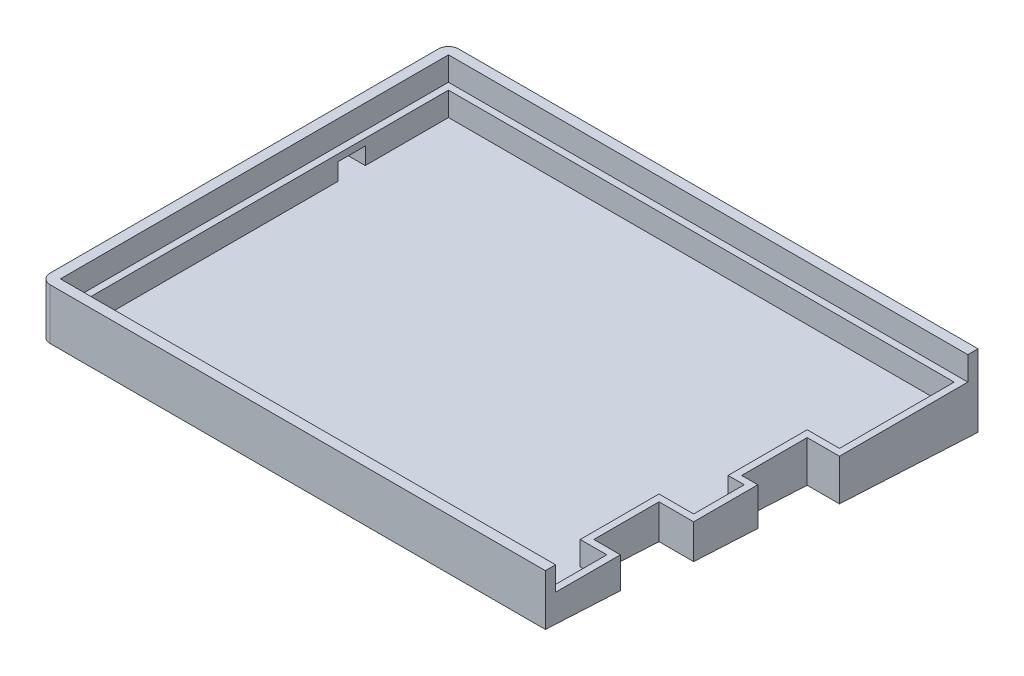
ISO-10303-21;
HEADER;
FILE_DESCRIPTION(('STEP AP214'),'2;1');
FILE_NAME('part.step','',(''),(''),'','','');
FILE_SCHEMA(('AUTOMOTIVE_DESIGN { 1 0 10303 214 1 1 1 1 }'));
ENDSEC;
DATA;
#1=APPLICATION_CONTEXT('core data for automotive mechanical design processes');
#2=APPLICATION_PROTOCOL_DEFINITION('international standard','automotive_design',2000,#1);
#3=PRODUCT_CONTEXT('',#1,'mechanical');
#4=PRODUCT('Part','Part','',(#3));
#5=PRODUCT_RELATED_PRODUCT_CATEGORY('part','',(#4));
#6=PRODUCT_DEFINITION_FORMATION('','',#4);
#7=PRODUCT_DEFINITION_CONTEXT('part definition',#1,'design');
#8=PRODUCT_DEFINITION('design','',#6,#7);
#9=PRODUCT_DEFINITION_SHAPE('','',#8);
#10=(LENGTH_UNIT() NAMED_UNIT(*) SI_UNIT(.MILLI.,.METRE.));
#11=(NAMED_UNIT(*) PLANE_ANGLE_UNIT() SI_UNIT($,.RADIAN.));
#12=(NAMED_UNIT(*) SI_UNIT($,.STERADIAN.) SOLID_ANGLE_UNIT());
#13=UNCERTAINTY_MEASURE_WITH_UNIT(LENGTH_MEASURE(1.E-05),#10,'distance_accuracy_value','');
#14=(GEOMETRIC_REPRESENTATION_CONTEXT(3) GLOBAL_UNCERTAINTY_ASSIGNED_CONTEXT((#13)) GLOBAL_UNIT_ASSIGNED_CONTEXT((#10,
#11,#12)) REPRESENTATION_CONTEXT('',''));
#15=CARTESIAN_POINT('',(0.,0.,0.));
#16=DIRECTION('',(0.,0.,1.));
#17=DIRECTION('',(1.,0.,0.));
#18=AXIS2_PLACEMENT_3D('',#15,#16,#17);
#19=CARTESIAN_POINT('',(0.,14.,3.));
#20=DIRECTION('',(0.,0.,-1.));
#21=DIRECTION('',(-1.,0.,0.));
#22=AXIS2_PLACEMENT_3D('',#19,#20,#21);
#23=PLANE('',#22);
#24=DIRECTION('',(1.,0.,0.));
#25=VECTOR('',#24,1.);
#26=CARTESIAN_POINT('',(0.,14.,3.));
#27=LINE('',#26,#25);
#28=CARTESIAN_POINT('',(0.,14.,3.));
#29=VERTEX_POINT('',#28);
#30=CARTESIAN_POINT('',(145.83,14.,3.));
#31=VERTEX_POINT('',#30);
#32=EDGE_CURVE('E465',#29,#31,#27,.T.);
#33=ORIENTED_EDGE('',*,*,#32,.F.);
#34=DIRECTION('',(0.,-1.,0.));
#35=VECTOR('',#34,1.);
#36=CARTESIAN_POINT('',(0.,-0.999999999999999,3.));
#37=LINE('',#36,#35);
#38=CARTESIAN_POINT('',(0.,-1.,3.));
#39=VERTEX_POINT('',#38);
#40=EDGE_CURVE('E500',#29,#39,#37,.T.);
#41=ORIENTED_EDGE('',*,*,#40,.T.);
#42=DIRECTION('',(1.,0.,0.));
#43=VECTOR('',#42,1.);
#44=CARTESIAN_POINT('',(0.,-1.,3.));
#45=LINE('',#44,#43);
#46=CARTESIAN_POINT('',(145.83,-1.,3.00000000000002));
#47=VERTEX_POINT('',#46);
#48=EDGE_CURVE('E455',#39,#47,#45,.T.);
#49=ORIENTED_EDGE('',*,*,#48,.T.);
#50=DIRECTION('',(0.,-1.,0.));
#51=VECTOR('',#50,1.);
#52=CARTESIAN_POINT('',(145.83,0.,3.));
#53=LINE('',#52,#51);
#54=EDGE_CURVE('E426',#31,#47,#53,.T.);
#55=ORIENTED_EDGE('',*,*,#54,.F.);
#56=EDGE_LOOP('',(#33,#41,#49,#55));
#57=FACE_BOUND('',#56,.T.);
#58=ADVANCED_FACE('F47',(#57),#23,.F.);
#59=CARTESIAN_POINT('',(-123.511553142895,-7.30413176995704,-117.29));
#60=DIRECTION('',(0.,-0.998629534754574,0.0523359562429439));
#61=DIRECTION('',(0.,-0.0523359562429439,-0.998629534754574));
#62=AXIS2_PLACEMENT_3D('',#59,#60,#61);
#63=PLANE('',#62);
#64=ORIENTED_EDGE('',*,*,#48,.F.);
#65=CARTESIAN_POINT('',(0.,-1.15722333784912,0.));
#66=DIRECTION('',(0.,-0.998629534754574,0.0523359562429439));
#67=DIRECTION('',(0.,0.052335956242944,0.998629534754574));
#68=AXIS2_PLACEMENT_3D('',#65,#66,#67);
#69=ELLIPSE('',#68,3.00411703799376,3.);
#70=CARTESIAN_POINT('',(-3.,-1.15722333784912,0.));
#71=VERTEX_POINT('',#70);
#72=EDGE_CURVE('E505',#39,#71,#69,.T.);
#73=ORIENTED_EDGE('',*,*,#72,.T.);
#74=DIRECTION('',(0.,-0.0523359562429439,-0.998629534754574));
#75=VECTOR('',#74,1.);
#76=CARTESIAN_POINT('',(-3.,-7.30413176995704,-117.29));
#77=LINE('',#76,#75);
#78=CARTESIAN_POINT('',(-3.,-7.14690843210792,-114.29));
#79=VERTEX_POINT('',#78);
#80=EDGE_CURVE('E450',#71,#79,#77,.T.);
#81=ORIENTED_EDGE('',*,*,#80,.T.);
#82=CARTESIAN_POINT('',(0.,-7.14690843210791,-114.29));
#83=DIRECTION('',(0.,-0.998629534754574,0.0523359562429439));
#84=DIRECTION('',(0.,-0.052335956242944,-0.998629534754574));
#85=AXIS2_PLACEMENT_3D('',#82,#83,#84);
#86=ELLIPSE('',#85,3.00411703799376,3.);
#87=CARTESIAN_POINT('',(0.,-7.30413176995704,-117.29));
#88=VERTEX_POINT('',#87);
#89=EDGE_CURVE('E503',#79,#88,#86,.T.);
#90=ORIENTED_EDGE('',*,*,#89,.T.);
#91=DIRECTION('',(1.,0.,0.));
#92=VECTOR('',#91,1.);
#93=CARTESIAN_POINT('',(-123.511553142895,-7.30413176995704,-117.29));
#94=LINE('',#93,#92);
#95=CARTESIAN_POINT('',(152.94,-7.30413176995704,-117.29));
#96=VERTEX_POINT('',#95);
#97=EDGE_CURVE('E453',#88,#96,#94,.T.);
#98=ORIENTED_EDGE('',*,*,#97,.T.);
#99=DIRECTION('',(0.,-0.0523359562429439,-0.998629534754574));
#100=VECTOR('',#99,1.);
#101=CARTESIAN_POINT('',(152.94,-7.30413176995704,-117.29));
#102=LINE('',#101,#100);
#103=CARTESIAN_POINT('',(152.94,-5.16589437520895,-76.49));
#104=VERTEX_POINT('',#103);
#105=EDGE_CURVE('E438',#104,#96,#102,.T.);
#106=ORIENTED_EDGE('',*,*,#105,.F.);
#107=DIRECTION('',(1.,0.,0.));
#108=VECTOR('',#107,1.);
#109=CARTESIAN_POINT('',(-123.511553142895,-5.16589437520896,-76.49));
#110=LINE('',#109,#108);
#111=CARTESIAN_POINT('',(143.44,-5.16589437520896,-76.49));
#112=VERTEX_POINT('',#111);
#113=EDGE_CURVE('E486',#112,#104,#110,.T.);
#114=ORIENTED_EDGE('',*,*,#113,.F.);
#115=DIRECTION('',(0.,-0.0523359562429439,-0.998629534754574));
#116=VECTOR('',#115,1.);
#117=CARTESIAN_POINT('',(143.44,-7.30413176995704,-117.29));
#118=LINE('',#117,#116);
#119=CARTESIAN_POINT('',(143.44,-4.15442423504626,-57.19));
#120=VERTEX_POINT('',#119);
#121=EDGE_CURVE('E488',#120,#112,#118,.T.);
#122=ORIENTED_EDGE('',*,*,#121,.F.);
#123=DIRECTION('',(-1.,0.,0.));
#124=VECTOR('',#123,1.);
#125=CARTESIAN_POINT('',(-123.511553142895,-4.15442423504626,-57.19));
#126=LINE('',#125,#124);
#127=CARTESIAN_POINT('',(148.2,-4.15442423504626,-57.19));
#128=VERTEX_POINT('',#127);
#129=EDGE_CURVE('E491',#128,#120,#126,.T.);
#130=ORIENTED_EDGE('',*,*,#129,.F.);
#131=DIRECTION('',(0.,-0.0523359562429439,-0.998629534754574));
#132=VECTOR('',#131,1.);
#133=CARTESIAN_POINT('',(148.2,-7.30413176995704,-117.29));
#134=LINE('',#133,#132);
#135=CARTESIAN_POINT('',(148.2,-3.16391720659678,-38.29));
#136=VERTEX_POINT('',#135);
#137=EDGE_CURVE('E493',#136,#128,#134,.T.);
#138=ORIENTED_EDGE('',*,*,#137,.F.);
#139=DIRECTION('',(1.,0.,0.));
#140=VECTOR('',#139,1.);
#141=CARTESIAN_POINT('',(-123.511553142895,-3.16391720659678,-38.29));
#142=LINE('',#141,#140);
#143=CARTESIAN_POINT('',(138.,-3.16391720659678,-38.29));
#144=VERTEX_POINT('',#143);
#145=EDGE_CURVE('E495',#144,#136,#142,.T.);
#146=ORIENTED_EDGE('',*,*,#145,.F.);
#147=DIRECTION('',(0.,0.0523359562429439,0.998629534754574));
#148=VECTOR('',#147,1.);
#149=CARTESIAN_POINT('',(138.,-7.30413176995704,-117.29));
#150=LINE('',#149,#148);
#151=CARTESIAN_POINT('',(138.,-2.15768784436238,-19.09));
#152=VERTEX_POINT('',#151);
#153=EDGE_CURVE('E497',#144,#152,#150,.T.);
#154=ORIENTED_EDGE('',*,*,#153,.T.);
#155=DIRECTION('',(-1.,0.,0.));
#156=VECTOR('',#155,1.);
#157=CARTESIAN_POINT('',(145.83,-2.15768784436238,-19.09));
#158=LINE('',#157,#156);
#159=CARTESIAN_POINT('',(145.83,-2.15768784436238,-19.09));
#160=VERTEX_POINT('',#159);
#161=EDGE_CURVE('E431',#160,#152,#158,.T.);
#162=ORIENTED_EDGE('',*,*,#161,.F.);
#163=DIRECTION('',(0.,-0.0523359562429439,-0.998629534754574));
#164=VECTOR('',#163,1.);
#165=CARTESIAN_POINT('',(145.83,-1.15405364258562,0.0604813885814169));
#166=LINE('',#165,#164);
#167=EDGE_CURVE('E429',#47,#160,#166,.T.);
#168=ORIENTED_EDGE('',*,*,#167,.F.);
#169=EDGE_LOOP('',(#64,#73,#81,#90,#98,#106,#114,#122,#130,#138,#146,#154,#162,#168));
#170=FACE_BOUND('',#169,.T.);
#171=ADVANCED_FACE('F528',(#170),#63,.T.);
#172=CARTESIAN_POINT('',(152.94,14.,0.));
#173=DIRECTION('',(1.,0.,0.));
#174=DIRECTION('',(0.,0.,-1.));
#175=AXIS2_PLACEMENT_3D('',#172,#173,#174);
#176=PLANE('',#175);
#177=DIRECTION('',(0.,0.,-1.));
#178=VECTOR('',#177,1.);
#179=CARTESIAN_POINT('',(152.94,7.,-76.49));
#180=LINE('',#179,#178);
#181=CARTESIAN_POINT('',(152.94,7.,-76.49));
#182=VERTEX_POINT('',#181);
#183=CARTESIAN_POINT('',(152.94,7.,-114.29));
#184=VERTEX_POINT('',#183);
#185=EDGE_CURVE('E413',#182,#184,#180,.T.);
#186=ORIENTED_EDGE('',*,*,#185,.F.);
#187=DIRECTION('',(0.,1.,0.));
#188=VECTOR('',#187,1.);
#189=CARTESIAN_POINT('',(152.94,-10.,-76.49));
#190=LINE('',#189,#188);
#191=EDGE_CURVE('E435',#104,#182,#190,.T.);
#192=ORIENTED_EDGE('',*,*,#191,.F.);
#193=ORIENTED_EDGE('',*,*,#105,.T.);
#194=DIRECTION('',(0.,-1.,0.));
#195=VECTOR('',#194,1.);
#196=CARTESIAN_POINT('',(152.94,14.,-117.29));
#197=LINE('',#196,#195);
#198=CARTESIAN_POINT('',(152.94,14.,-117.29));
#199=VERTEX_POINT('',#198);
#200=EDGE_CURVE('E483',#199,#96,#197,.T.);
#201=ORIENTED_EDGE('',*,*,#200,.F.);
#202=DIRECTION('',(0.,0.,1.));
#203=VECTOR('',#202,1.);
#204=CARTESIAN_POINT('',(152.94,14.,0.));
#205=LINE('',#204,#203);
#206=CARTESIAN_POINT('',(152.94,14.,-114.29));
#207=VERTEX_POINT('',#206);
#208=EDGE_CURVE('E457',#199,#207,#205,.T.);
#209=ORIENTED_EDGE('',*,*,#208,.T.);
#210=DIRECTION('',(0.,-1.,0.));
#211=VECTOR('',#210,1.);
#212=CARTESIAN_POINT('',(152.94,14.,-114.29));
#213=LINE('',#212,#211);
#214=EDGE_CURVE('E474',#207,#184,#213,.T.);
#215=ORIENTED_EDGE('',*,*,#214,.T.);
#216=EDGE_LOOP('',(#186,#192,#193,#201,#209,#215));
#217=FACE_BOUND('',#216,.T.);
#218=ADVANCED_FACE('F543',(#217),#176,.T.);
#219=CARTESIAN_POINT('',(0.,14.,-117.29));
#220=DIRECTION('',(0.,0.,-1.));
#221=DIRECTION('',(-1.,0.,0.));
#222=AXIS2_PLACEMENT_3D('',#219,#220,#221);
#223=PLANE('',#222);
#224=ORIENTED_EDGE('',*,*,#97,.F.);
#225=DIRECTION('',(0.,-1.,0.));
#226=VECTOR('',#225,1.);
#227=CARTESIAN_POINT('',(0.,14.,-117.29));
#228=LINE('',#227,#226);
#229=CARTESIAN_POINT('',(0.,14.,-117.29));
#230=VERTEX_POINT('',#229);
#231=EDGE_CURVE('E11',#88,#230,#228,.F.);
#232=ORIENTED_EDGE('',*,*,#231,.T.);
#233=DIRECTION('',(1.,0.,0.));
#234=VECTOR('',#233,1.);
#235=CARTESIAN_POINT('',(0.,14.,-117.29));
#236=LINE('',#235,#234);
#237=EDGE_CURVE('E460',#230,#199,#236,.T.);
#238=ORIENTED_EDGE('',*,*,#237,.T.);
#239=ORIENTED_EDGE('',*,*,#200,.T.);
#240=EDGE_LOOP('',(#224,#232,#238,#239));
#241=FACE_BOUND('',#240,.T.);
#242=ADVANCED_FACE('F537',(#241),#223,.T.);
#243=CARTESIAN_POINT('',(-3.,14.,0.));
#244=DIRECTION('',(-1.,0.,0.));
#245=DIRECTION('',(0.,0.,1.));
#246=AXIS2_PLACEMENT_3D('',#243,#244,#245);
#247=PLANE('',#246);
#248=DIRECTION('',(0.,-1.,0.));
#249=VECTOR('',#248,1.);
#250=CARTESIAN_POINT('',(-3.,0.,-79.69));
#251=LINE('',#250,#249);
#252=CARTESIAN_POINT('',(-3.,5.,-79.69));
#253=VERTEX_POINT('',#252);
#254=CARTESIAN_POINT('',(-3.,0.,-79.69));
#255=VERTEX_POINT('',#254);
#256=EDGE_CURVE('E279',#253,#255,#251,.T.);
#257=ORIENTED_EDGE('',*,*,#256,.T.);
#258=DIRECTION('',(0.,0.,-1.));
#259=VECTOR('',#258,1.);
#260=CARTESIAN_POINT('',(-3.,0.,0.));
#261=LINE('',#260,#259);
#262=CARTESIAN_POINT('',(-3.,0.,-87.79));
#263=VERTEX_POINT('',#262);
#264=EDGE_CURVE('E268',#255,#263,#261,.T.);
#265=ORIENTED_EDGE('',*,*,#264,.T.);
#266=DIRECTION('',(0.,-1.,0.));
#267=VECTOR('',#266,1.);
#268=CARTESIAN_POINT('',(-3.,0.,-87.79));
#269=LINE('',#268,#267);
#270=CARTESIAN_POINT('',(-3.,5.,-87.79));
#271=VERTEX_POINT('',#270);
#272=EDGE_CURVE('E286',#271,#263,#269,.T.);
#273=ORIENTED_EDGE('',*,*,#272,.F.);
#274=DIRECTION('',(0.,0.,-1.));
#275=VECTOR('',#274,1.);
#276=CARTESIAN_POINT('',(-3.,5.,0.));
#277=LINE('',#276,#275);
#278=EDGE_CURVE('E284',#253,#271,#277,.T.);
#279=ORIENTED_EDGE('',*,*,#278,.F.);
#280=EDGE_LOOP('',(#257,#265,#273,#279));
#281=FACE_BOUND('',#280,.T.);
#282=ORIENTED_EDGE('',*,*,#80,.F.);
#283=DIRECTION('',(0.,-1.,0.));
#284=VECTOR('',#283,1.);
#285=CARTESIAN_POINT('',(-3.,14.,0.));
#286=LINE('',#285,#284);
#287=CARTESIAN_POINT('',(-3.,14.,0.));
#288=VERTEX_POINT('',#287);
#289=EDGE_CURVE('E510',#71,#288,#286,.F.);
#290=ORIENTED_EDGE('',*,*,#289,.T.);
#291=DIRECTION('',(0.,0.,-1.));
#292=VECTOR('',#291,1.);
#293=CARTESIAN_POINT('',(-3.,14.,0.));
#294=LINE('',#293,#292);
#295=CARTESIAN_POINT('',(-3.,14.,-114.29));
#296=VERTEX_POINT('',#295);
#297=EDGE_CURVE('E462',#288,#296,#294,.T.);
#298=ORIENTED_EDGE('',*,*,#297,.T.);
#299=DIRECTION('',(0.,-1.,0.));
#300=VECTOR('',#299,1.);
#301=CARTESIAN_POINT('',(-3.,14.,-114.29));
#302=LINE('',#301,#300);
#303=EDGE_CURVE('E507',#296,#79,#302,.T.);
#304=ORIENTED_EDGE('',*,*,#303,.T.);
#305=EDGE_LOOP('',(#282,#290,#298,#304));
#306=FACE_BOUND('',#305,.T.);
#307=ADVANCED_FACE('F282',(#281,#306),#247,.T.);
#308=CARTESIAN_POINT('',(138.,14.,0.));
#309=DIRECTION('',(-1.,0.,0.));
#310=DIRECTION('',(0.,0.,1.));
#311=AXIS2_PLACEMENT_3D('',#308,#309,#310);
#312=PLANE('',#311);
#313=DIRECTION('',(0.,1.,0.));
#314=VECTOR('',#313,1.);
#315=CARTESIAN_POINT('',(138.,-10.,-38.29));
#316=LINE('',#315,#314);
#317=CARTESIAN_POINT('',(138.,7.,-38.29));
#318=VERTEX_POINT('',#317);
#319=EDGE_CURVE('E436',#144,#318,#316,.T.);
#320=ORIENTED_EDGE('',*,*,#319,.T.);
#321=DIRECTION('',(0.,0.,-1.));
#322=VECTOR('',#321,1.);
#323=CARTESIAN_POINT('',(138.,7.,-19.09));
#324=LINE('',#323,#322);
#325=CARTESIAN_POINT('',(138.,7.,-19.09));
#326=VERTEX_POINT('',#325);
#327=EDGE_CURVE('E395',#326,#318,#324,.T.);
#328=ORIENTED_EDGE('',*,*,#327,.F.);
#329=DIRECTION('',(0.,-1.,0.));
#330=VECTOR('',#329,1.);
#331=CARTESIAN_POINT('',(138.,0.,-19.09));
#332=LINE('',#331,#330);
#333=EDGE_CURVE('E417',#326,#152,#332,.T.);
#334=ORIENTED_EDGE('',*,*,#333,.T.);
#335=ORIENTED_EDGE('',*,*,#153,.F.);
#336=EDGE_LOOP('',(#320,#328,#334,#335));
#337=FACE_BOUND('',#336,.T.);
#338=ADVANCED_FACE('F584',(#337),#312,.F.);
#339=CARTESIAN_POINT('',(0.,14.,0.));
#340=DIRECTION('',(0.,0.,-1.));
#341=DIRECTION('',(-1.,0.,0.));
#342=AXIS2_PLACEMENT_3D('',#339,#340,#341);
#343=PLANE('',#342);
#344=DIRECTION('',(1.,0.,0.));
#345=VECTOR('',#344,1.);
#346=CARTESIAN_POINT('',(0.,7.,0.));
#347=LINE('',#346,#345);
#348=CARTESIAN_POINT('',(0.,7.,0.));
#349=VERTEX_POINT('',#348);
#350=CARTESIAN_POINT('',(145.83,7.,0.));
#351=VERTEX_POINT('',#350);
#352=EDGE_CURVE('E386',#349,#351,#347,.T.);
#353=ORIENTED_EDGE('',*,*,#352,.F.);
#354=DIRECTION('',(0.,-1.,0.));
#355=VECTOR('',#354,1.);
#356=CARTESIAN_POINT('',(0.,14.,0.));
#357=LINE('',#356,#355);
#358=CARTESIAN_POINT('',(0.,14.,0.));
#359=VERTEX_POINT('',#358);
#360=EDGE_CURVE('E480',#359,#349,#357,.T.);
#361=ORIENTED_EDGE('',*,*,#360,.F.);
#362=DIRECTION('',(1.,0.,0.));
#363=VECTOR('',#362,1.);
#364=CARTESIAN_POINT('',(0.,14.,0.));
#365=LINE('',#364,#363);
#366=CARTESIAN_POINT('',(145.83,14.,0.));
#367=VERTEX_POINT('',#366);
#368=EDGE_CURVE('E467',#359,#367,#365,.T.);
#369=ORIENTED_EDGE('',*,*,#368,.T.);
#370=DIRECTION('',(0.,1.,0.));
#371=VECTOR('',#370,1.);
#372=CARTESIAN_POINT('',(145.83,0.,0.));
#373=LINE('',#372,#371);
#374=EDGE_CURVE('E421',#351,#367,#373,.T.);
#375=ORIENTED_EDGE('',*,*,#374,.F.);
#376=EDGE_LOOP('',(#353,#361,#369,#375));
#377=FACE_BOUND('',#376,.T.);
#378=ADVANCED_FACE('F593',(#377),#343,.T.);
#379=CARTESIAN_POINT('',(0.,14.,0.));
#380=DIRECTION('',(-1.,0.,0.));
#381=DIRECTION('',(0.,0.,1.));
#382=AXIS2_PLACEMENT_3D('',#379,#380,#381);
#383=PLANE('',#382);
#384=ORIENTED_EDGE('',*,*,#360,.T.);
#385=DIRECTION('',(0.,0.,1.));
#386=VECTOR('',#385,1.);
#387=CARTESIAN_POINT('',(0.,7.,-114.29));
#388=LINE('',#387,#386);
#389=CARTESIAN_POINT('',(0.,7.,-114.29));
#390=VERTEX_POINT('',#389);
#391=EDGE_CURVE('E384',#390,#349,#388,.T.);
#392=ORIENTED_EDGE('',*,*,#391,.F.);
#393=DIRECTION('',(0.,-1.,0.));
#394=VECTOR('',#393,1.);
#395=CARTESIAN_POINT('',(0.,14.,-114.29));
#396=LINE('',#395,#394);
#397=CARTESIAN_POINT('',(0.,14.,-114.29));
#398=VERTEX_POINT('',#397);
#399=EDGE_CURVE('E477',#398,#390,#396,.T.);
#400=ORIENTED_EDGE('',*,*,#399,.F.);
#401=DIRECTION('',(0.,0.,-1.));
#402=VECTOR('',#401,1.);
#403=CARTESIAN_POINT('',(0.,14.,0.));
#404=LINE('',#403,#402);
#405=EDGE_CURVE('E470',#359,#398,#404,.T.);
#406=ORIENTED_EDGE('',*,*,#405,.F.);
#407=EDGE_LOOP('',(#384,#392,#400,#406));
#408=FACE_BOUND('',#407,.T.);
#409=ADVANCED_FACE('F595',(#408),#383,.F.);
#410=CARTESIAN_POINT('',(0.,14.,-114.29));
#411=DIRECTION('',(0.,0.,-1.));
#412=DIRECTION('',(-1.,0.,0.));
#413=AXIS2_PLACEMENT_3D('',#410,#411,#412);
#414=PLANE('',#413);
#415=ORIENTED_EDGE('',*,*,#399,.T.);
#416=DIRECTION('',(-1.,0.,0.));
#417=VECTOR('',#416,1.);
#418=CARTESIAN_POINT('',(152.94,7.,-114.29));
#419=LINE('',#418,#417);
#420=EDGE_CURVE('E415',#184,#390,#419,.T.);
#421=ORIENTED_EDGE('',*,*,#420,.F.);
#422=ORIENTED_EDGE('',*,*,#214,.F.);
#423=DIRECTION('',(1.,0.,0.));
#424=VECTOR('',#423,1.);
#425=CARTESIAN_POINT('',(0.,14.,-114.29));
#426=LINE('',#425,#424);
#427=EDGE_CURVE('E472',#398,#207,#426,.T.);
#428=ORIENTED_EDGE('',*,*,#427,.F.);
#429=EDGE_LOOP('',(#415,#421,#422,#428));
#430=FACE_BOUND('',#429,.T.);
#431=ADVANCED_FACE('F552',(#430),#414,.F.);
#432=CARTESIAN_POINT('',(0.,14.,0.));
#433=DIRECTION('',(0.,1.,0.));
#434=DIRECTION('',(0.,0.,1.));
#435=AXIS2_PLACEMENT_3D('',#432,#433,#434);
#436=PLANE('',#435);
#437=ORIENTED_EDGE('',*,*,#297,.F.);
#438=CARTESIAN_POINT('',(0.,14.,0.));
#439=DIRECTION('',(0.,1.,0.));
#440=DIRECTION('',(0.,0.,1.));
#441=AXIS2_PLACEMENT_3D('',#438,#439,#440);
#442=CIRCLE('',#441,3.);
#443=EDGE_CURVE('E55',#288,#29,#442,.T.);
#444=ORIENTED_EDGE('',*,*,#443,.T.);
#445=ORIENTED_EDGE('',*,*,#32,.T.);
#446=DIRECTION('',(0.,0.,1.));
#447=VECTOR('',#446,1.);
#448=CARTESIAN_POINT('',(145.83,14.,0.));
#449=LINE('',#448,#447);
#450=EDGE_CURVE('E423',#367,#31,#449,.T.);
#451=ORIENTED_EDGE('',*,*,#450,.F.);
#452=ORIENTED_EDGE('',*,*,#368,.F.);
#453=ORIENTED_EDGE('',*,*,#405,.T.);
#454=ORIENTED_EDGE('',*,*,#427,.T.);
#455=ORIENTED_EDGE('',*,*,#208,.F.);
#456=ORIENTED_EDGE('',*,*,#237,.F.);
#457=CARTESIAN_POINT('',(0.,14.,-114.29));
#458=DIRECTION('',(0.,1.,0.));
#459=DIRECTION('',(0.,0.,1.));
#460=AXIS2_PLACEMENT_3D('',#457,#458,#459);
#461=CIRCLE('',#460,3.);
#462=EDGE_CURVE('E512',#230,#296,#461,.T.);
#463=ORIENTED_EDGE('',*,*,#462,.T.);
#464=EDGE_LOOP('',(#437,#444,#445,#451,#452,#453,#454,#455,#456,#463));
#465=FACE_BOUND('',#464,.T.);
#466=ADVANCED_FACE('F517',(#465),#436,.T.);
#467=CARTESIAN_POINT('',(0.,-10.,-38.29));
#468=DIRECTION('',(0.,0.,-1.));
#469=DIRECTION('',(-1.,0.,0.));
#470=AXIS2_PLACEMENT_3D('',#467,#468,#469);
#471=PLANE('',#470);
#472=ORIENTED_EDGE('',*,*,#145,.T.);
#473=DIRECTION('',(0.,1.,0.));
#474=VECTOR('',#473,1.);
#475=CARTESIAN_POINT('',(148.2,-10.,-38.29));
#476=LINE('',#475,#474);
#477=CARTESIAN_POINT('',(148.2,7.,-38.29));
#478=VERTEX_POINT('',#477);
#479=EDGE_CURVE('E439',#136,#478,#476,.T.);
#480=ORIENTED_EDGE('',*,*,#479,.T.);
#481=DIRECTION('',(1.,0.,0.));
#482=VECTOR('',#481,1.);
#483=CARTESIAN_POINT('',(138.,7.,-38.29));
#484=LINE('',#483,#482);
#485=EDGE_CURVE('E398',#318,#478,#484,.T.);
#486=ORIENTED_EDGE('',*,*,#485,.F.);
#487=ORIENTED_EDGE('',*,*,#319,.F.);
#488=EDGE_LOOP('',(#472,#480,#486,#487));
#489=FACE_BOUND('',#488,.T.);
#490=ADVANCED_FACE('F581',(#489),#471,.F.);
#491=CARTESIAN_POINT('',(148.2,-10.,0.));
#492=DIRECTION('',(-1.,0.,0.));
#493=DIRECTION('',(0.,0.,1.));
#494=AXIS2_PLACEMENT_3D('',#491,#492,#493);
#495=PLANE('',#494);
#496=ORIENTED_EDGE('',*,*,#137,.T.);
#497=DIRECTION('',(0.,1.,0.));
#498=VECTOR('',#497,1.);
#499=CARTESIAN_POINT('',(148.2,-10.,-57.19));
#500=LINE('',#499,#498);
#501=CARTESIAN_POINT('',(148.2,7.,-57.19));
#502=VERTEX_POINT('',#501);
#503=EDGE_CURVE('E441',#128,#502,#500,.T.);
#504=ORIENTED_EDGE('',*,*,#503,.T.);
#505=DIRECTION('',(0.,0.,-1.));
#506=VECTOR('',#505,1.);
#507=CARTESIAN_POINT('',(148.2,7.,-38.29));
#508=LINE('',#507,#506);
#509=EDGE_CURVE('E401',#478,#502,#508,.T.);
#510=ORIENTED_EDGE('',*,*,#509,.F.);
#511=ORIENTED_EDGE('',*,*,#479,.F.);
#512=EDGE_LOOP('',(#496,#504,#510,#511));
#513=FACE_BOUND('',#512,.T.);
#514=ADVANCED_FACE('F576',(#513),#495,.F.);
#515=CARTESIAN_POINT('',(0.,-10.,-57.19));
#516=DIRECTION('',(0.,0.,1.));
#517=DIRECTION('',(1.,0.,0.));
#518=AXIS2_PLACEMENT_3D('',#515,#516,#517);
#519=PLANE('',#518);
#520=ORIENTED_EDGE('',*,*,#129,.T.);
#521=DIRECTION('',(0.,1.,0.));
#522=VECTOR('',#521,1.);
#523=CARTESIAN_POINT('',(143.44,-10.,-57.19));
#524=LINE('',#523,#522);
#525=CARTESIAN_POINT('',(143.44,7.,-57.19));
#526=VERTEX_POINT('',#525);
#527=EDGE_CURVE('E443',#120,#526,#524,.T.);
#528=ORIENTED_EDGE('',*,*,#527,.T.);
#529=DIRECTION('',(-1.,0.,0.));
#530=VECTOR('',#529,1.);
#531=CARTESIAN_POINT('',(148.2,7.,-57.19));
#532=LINE('',#531,#530);
#533=EDGE_CURVE('E404',#502,#526,#532,.T.);
#534=ORIENTED_EDGE('',*,*,#533,.F.);
#535=ORIENTED_EDGE('',*,*,#503,.F.);
#536=EDGE_LOOP('',(#520,#528,#534,#535));
#537=FACE_BOUND('',#536,.T.);
#538=ADVANCED_FACE('F570',(#537),#519,.F.);
#539=CARTESIAN_POINT('',(143.44,-10.,0.));
#540=DIRECTION('',(-1.,0.,0.));
#541=DIRECTION('',(0.,0.,1.));
#542=AXIS2_PLACEMENT_3D('',#539,#540,#541);
#543=PLANE('',#542);
#544=ORIENTED_EDGE('',*,*,#121,.T.);
#545=DIRECTION('',(0.,1.,0.));
#546=VECTOR('',#545,1.);
#547=CARTESIAN_POINT('',(143.44,-10.,-76.49));
#548=LINE('',#547,#546);
#549=CARTESIAN_POINT('',(143.44,7.,-76.49));
#550=VERTEX_POINT('',#549);
#551=EDGE_CURVE('E445',#112,#550,#548,.T.);
#552=ORIENTED_EDGE('',*,*,#551,.T.);
#553=DIRECTION('',(0.,0.,-1.));
#554=VECTOR('',#553,1.);
#555=CARTESIAN_POINT('',(143.44,7.,-57.19));
#556=LINE('',#555,#554);
#557=EDGE_CURVE('E407',#526,#550,#556,.T.);
#558=ORIENTED_EDGE('',*,*,#557,.F.);
#559=ORIENTED_EDGE('',*,*,#527,.F.);
#560=EDGE_LOOP('',(#544,#552,#558,#559));
#561=FACE_BOUND('',#560,.T.);
#562=ADVANCED_FACE('F567',(#561),#543,.F.);
#563=CARTESIAN_POINT('',(0.,-10.,-76.49));
#564=DIRECTION('',(0.,0.,-1.));
#565=DIRECTION('',(-1.,0.,0.));
#566=AXIS2_PLACEMENT_3D('',#563,#564,#565);
#567=PLANE('',#566);
#568=ORIENTED_EDGE('',*,*,#113,.T.);
#569=ORIENTED_EDGE('',*,*,#191,.T.);
#570=DIRECTION('',(1.,0.,0.));
#571=VECTOR('',#570,1.);
#572=CARTESIAN_POINT('',(143.44,7.,-76.49));
#573=LINE('',#572,#571);
#574=EDGE_CURVE('E410',#550,#182,#573,.T.);
#575=ORIENTED_EDGE('',*,*,#574,.F.);
#576=ORIENTED_EDGE('',*,*,#551,.F.);
#577=EDGE_LOOP('',(#568,#569,#575,#576));
#578=FACE_BOUND('',#577,.T.);
#579=ADVANCED_FACE('F560',(#578),#567,.F.);
#580=CARTESIAN_POINT('',(145.83,0.,-19.09));
#581=DIRECTION('',(0.,0.,-1.));
#582=DIRECTION('',(-1.,0.,0.));
#583=AXIS2_PLACEMENT_3D('',#580,#581,#582);
#584=PLANE('',#583);
#585=ORIENTED_EDGE('',*,*,#333,.F.);
#586=DIRECTION('',(-1.,0.,0.));
#587=VECTOR('',#586,1.);
#588=CARTESIAN_POINT('',(145.83,7.,-19.09));
#589=LINE('',#588,#587);
#590=CARTESIAN_POINT('',(145.83,7.,-19.09));
#591=VERTEX_POINT('',#590);
#592=EDGE_CURVE('E392',#591,#326,#589,.T.);
#593=ORIENTED_EDGE('',*,*,#592,.F.);
#594=DIRECTION('',(0.,-1.,0.));
#595=VECTOR('',#594,1.);
#596=CARTESIAN_POINT('',(145.83,0.,-19.09));
#597=LINE('',#596,#595);
#598=EDGE_CURVE('E418',#591,#160,#597,.T.);
#599=ORIENTED_EDGE('',*,*,#598,.T.);
#600=ORIENTED_EDGE('',*,*,#161,.T.);
#601=EDGE_LOOP('',(#585,#593,#599,#600));
#602=FACE_BOUND('',#601,.T.);
#603=ADVANCED_FACE('F587',(#602),#584,.T.);
#604=CARTESIAN_POINT('',(145.83,0.,0.));
#605=DIRECTION('',(1.,0.,0.));
#606=DIRECTION('',(0.,0.,-1.));
#607=AXIS2_PLACEMENT_3D('',#604,#605,#606);
#608=PLANE('',#607);
#609=ORIENTED_EDGE('',*,*,#598,.F.);
#610=DIRECTION('',(0.,0.,-1.));
#611=VECTOR('',#610,1.);
#612=CARTESIAN_POINT('',(145.83,7.,0.));
#613=LINE('',#612,#611);
#614=EDGE_CURVE('E389',#351,#591,#613,.T.);
#615=ORIENTED_EDGE('',*,*,#614,.F.);
#616=ORIENTED_EDGE('',*,*,#374,.T.);
#617=ORIENTED_EDGE('',*,*,#450,.T.);
#618=ORIENTED_EDGE('',*,*,#54,.T.);
#619=ORIENTED_EDGE('',*,*,#167,.T.);
#620=EDGE_LOOP('',(#609,#615,#616,#617,#618,#619));
#621=FACE_BOUND('',#620,.T.);
#622=ADVANCED_FACE('F589',(#621),#608,.T.);
#623=CARTESIAN_POINT('',(0.,14.,0.));
#624=DIRECTION('',(0.,1.,0.));
#625=DIRECTION('',(0.,0.,1.));
#626=AXIS2_PLACEMENT_3D('',#623,#624,#625);
#627=CYLINDRICAL_SURFACE('',#626,3.);
#628=ORIENTED_EDGE('',*,*,#443,.F.);
#629=ORIENTED_EDGE('',*,*,#289,.F.);
#630=ORIENTED_EDGE('',*,*,#72,.F.);
#631=ORIENTED_EDGE('',*,*,#40,.F.);
#632=EDGE_LOOP('',(#628,#629,#630,#631));
#633=FACE_BOUND('',#632,.T.);
#634=ADVANCED_FACE('F525',(#633),#627,.T.);
#635=CARTESIAN_POINT('',(0.,14.,-114.29));
#636=DIRECTION('',(0.,-1.,0.));
#637=DIRECTION('',(0.,0.,-1.));
#638=AXIS2_PLACEMENT_3D('',#635,#636,#637);
#639=CYLINDRICAL_SURFACE('',#638,3.);
#640=ORIENTED_EDGE('',*,*,#462,.F.);
#641=ORIENTED_EDGE('',*,*,#231,.F.);
#642=ORIENTED_EDGE('',*,*,#89,.F.);
#643=ORIENTED_EDGE('',*,*,#303,.F.);
#644=EDGE_LOOP('',(#640,#641,#642,#643));
#645=FACE_BOUND('',#644,.T.);
#646=ADVANCED_FACE('F49',(#645),#639,.T.);
#647=CARTESIAN_POINT('',(0.,7.,0.));
#648=DIRECTION('',(0.,1.,0.));
#649=DIRECTION('',(0.,0.,1.));
#650=AXIS2_PLACEMENT_3D('',#647,#648,#649);
#651=PLANE('',#650);
#652=ORIENTED_EDGE('',*,*,#391,.T.);
#653=ORIENTED_EDGE('',*,*,#352,.T.);
#654=ORIENTED_EDGE('',*,*,#614,.T.);
#655=ORIENTED_EDGE('',*,*,#592,.T.);
#656=ORIENTED_EDGE('',*,*,#327,.T.);
#657=ORIENTED_EDGE('',*,*,#485,.T.);
#658=ORIENTED_EDGE('',*,*,#509,.T.);
#659=ORIENTED_EDGE('',*,*,#533,.T.);
#660=ORIENTED_EDGE('',*,*,#557,.T.);
#661=ORIENTED_EDGE('',*,*,#574,.T.);
#662=ORIENTED_EDGE('',*,*,#185,.T.);
#663=ORIENTED_EDGE('',*,*,#420,.T.);
#664=EDGE_LOOP('',(#652,#653,#654,#655,#656,#657,#658,#659,#660,#661,#662,#663));
#665=FACE_BOUND('',#664,.T.);
#666=DIRECTION('',(-1.,0.,0.));
#667=VECTOR('',#666,1.);
#668=CARTESIAN_POINT('',(150.94,7.,-112.29));
#669=LINE('',#668,#667);
#670=CARTESIAN_POINT('',(150.94,7.,-112.29));
#671=VERTEX_POINT('',#670);
#672=CARTESIAN_POINT('',(2.,7.,-112.29));
#673=VERTEX_POINT('',#672);
#674=EDGE_CURVE('E300',#671,#673,#669,.T.);
#675=ORIENTED_EDGE('',*,*,#674,.F.);
#676=DIRECTION('',(0.,0.,-1.));
#677=VECTOR('',#676,1.);
#678=CARTESIAN_POINT('',(150.94,7.,-78.49));
#679=LINE('',#678,#677);
#680=CARTESIAN_POINT('',(150.94,7.,-78.49));
#681=VERTEX_POINT('',#680);
#682=EDGE_CURVE('E298',#681,#671,#679,.T.);
#683=ORIENTED_EDGE('',*,*,#682,.F.);
#684=DIRECTION('',(1.,0.,0.));
#685=VECTOR('',#684,1.);
#686=CARTESIAN_POINT('',(141.44,7.,-78.49));
#687=LINE('',#686,#685);
#688=CARTESIAN_POINT('',(141.44,7.,-78.49));
#689=VERTEX_POINT('',#688);
#690=EDGE_CURVE('E322',#689,#681,#687,.T.);
#691=ORIENTED_EDGE('',*,*,#690,.F.);
#692=DIRECTION('',(0.,0.,-1.));
#693=VECTOR('',#692,1.);
#694=CARTESIAN_POINT('',(141.44,7.,-55.19));
#695=LINE('',#694,#693);
#696=CARTESIAN_POINT('',(141.44,7.,-55.19));
#697=VERTEX_POINT('',#696);
#698=EDGE_CURVE('E319',#697,#689,#695,.T.);
#699=ORIENTED_EDGE('',*,*,#698,.F.);
#700=DIRECTION('',(-1.,0.,0.));
#701=VECTOR('',#700,1.);
#702=CARTESIAN_POINT('',(146.2,7.,-55.19));
#703=LINE('',#702,#701);
#704=CARTESIAN_POINT('',(146.2,7.,-55.19));
#705=VERTEX_POINT('',#704);
#706=EDGE_CURVE('E317',#705,#697,#703,.T.);
#707=ORIENTED_EDGE('',*,*,#706,.F.);
#708=DIRECTION('',(0.,0.,-1.));
#709=VECTOR('',#708,1.);
#710=CARTESIAN_POINT('',(146.2,7.,-40.29));
#711=LINE('',#710,#709);
#712=CARTESIAN_POINT('',(146.2,7.,-40.29));
#713=VERTEX_POINT('',#712);
#714=EDGE_CURVE('E315',#713,#705,#711,.T.);
#715=ORIENTED_EDGE('',*,*,#714,.F.);
#716=DIRECTION('',(1.,0.,0.));
#717=VECTOR('',#716,1.);
#718=CARTESIAN_POINT('',(136.,7.,-40.29));
#719=LINE('',#718,#717);
#720=CARTESIAN_POINT('',(136.,7.,-40.29));
#721=VERTEX_POINT('',#720);
#722=EDGE_CURVE('E313',#721,#713,#719,.T.);
#723=ORIENTED_EDGE('',*,*,#722,.F.);
#724=DIRECTION('',(0.,0.,-1.));
#725=VECTOR('',#724,1.);
#726=CARTESIAN_POINT('',(136.,7.,-17.09));
#727=LINE('',#726,#725);
#728=CARTESIAN_POINT('',(136.,7.,-17.09));
#729=VERTEX_POINT('',#728);
#730=EDGE_CURVE('E311',#729,#721,#727,.T.);
#731=ORIENTED_EDGE('',*,*,#730,.F.);
#732=DIRECTION('',(-1.,0.,0.));
#733=VECTOR('',#732,1.);
#734=CARTESIAN_POINT('',(143.83,7.,-17.09));
#735=LINE('',#734,#733);
#736=CARTESIAN_POINT('',(143.83,7.,-17.09));
#737=VERTEX_POINT('',#736);
#738=EDGE_CURVE('E309',#737,#729,#735,.T.);
#739=ORIENTED_EDGE('',*,*,#738,.F.);
#740=DIRECTION('',(0.,0.,-1.));
#741=VECTOR('',#740,1.);
#742=CARTESIAN_POINT('',(143.83,7.,-2.00000000000001));
#743=LINE('',#742,#741);
#744=CARTESIAN_POINT('',(143.83,7.,-2.00000000000001));
#745=VERTEX_POINT('',#744);
#746=EDGE_CURVE('E307',#745,#737,#743,.T.);
#747=ORIENTED_EDGE('',*,*,#746,.F.);
#748=DIRECTION('',(1.,0.,0.));
#749=VECTOR('',#748,1.);
#750=CARTESIAN_POINT('',(2.00000000000001,7.,-2.));
#751=LINE('',#750,#749);
#752=CARTESIAN_POINT('',(2.00000000000001,7.,-2.));
#753=VERTEX_POINT('',#752);
#754=EDGE_CURVE('E305',#753,#745,#751,.T.);
#755=ORIENTED_EDGE('',*,*,#754,.F.);
#756=DIRECTION('',(0.,0.,1.));
#757=VECTOR('',#756,1.);
#758=CARTESIAN_POINT('',(2.,7.,-112.29));
#759=LINE('',#758,#757);
#760=EDGE_CURVE('E303',#673,#753,#759,.T.);
#761=ORIENTED_EDGE('',*,*,#760,.F.);
#762=EDGE_LOOP('',(#675,#683,#691,#699,#707,#715,#723,#731,#739,#747,#755,#761));
#763=FACE_BOUND('',#762,.T.);
#764=ADVANCED_FACE('F554',(#665,#763),#651,.T.);
#765=CARTESIAN_POINT('',(150.94,7.,-78.49));
#766=DIRECTION('',(-1.,0.,0.));
#767=DIRECTION('',(0.,0.,1.));
#768=AXIS2_PLACEMENT_3D('',#765,#766,#767);
#769=PLANE('',#768);
#770=DIRECTION('',(0.,0.,-1.));
#771=VECTOR('',#770,1.);
#772=CARTESIAN_POINT('',(150.94,0.,-78.49));
#773=LINE('',#772,#771);
#774=CARTESIAN_POINT('',(150.94,0.,-78.49));
#775=VERTEX_POINT('',#774);
#776=CARTESIAN_POINT('',(150.94,0.,-112.29));
#777=VERTEX_POINT('',#776);
#778=EDGE_CURVE('E325',#775,#777,#773,.T.);
#779=ORIENTED_EDGE('',*,*,#778,.F.);
#780=DIRECTION('',(0.,-1.,0.));
#781=VECTOR('',#780,1.);
#782=CARTESIAN_POINT('',(150.94,7.,-78.49));
#783=LINE('',#782,#781);
#784=EDGE_CURVE('E324',#681,#775,#783,.T.);
#785=ORIENTED_EDGE('',*,*,#784,.F.);
#786=ORIENTED_EDGE('',*,*,#682,.T.);
#787=DIRECTION('',(0.,-1.,0.));
#788=VECTOR('',#787,1.);
#789=CARTESIAN_POINT('',(150.94,7.,-112.29));
#790=LINE('',#789,#788);
#791=EDGE_CURVE('E381',#671,#777,#790,.T.);
#792=ORIENTED_EDGE('',*,*,#791,.T.);
#793=EDGE_LOOP('',(#779,#785,#786,#792));
#794=FACE_BOUND('',#793,.T.);
#795=ADVANCED_FACE('F805',(#794),#769,.T.);
#796=CARTESIAN_POINT('',(150.94,7.,-112.29));
#797=DIRECTION('',(0.,0.,1.));
#798=DIRECTION('',(1.,0.,0.));
#799=AXIS2_PLACEMENT_3D('',#796,#797,#798);
#800=PLANE('',#799);
#801=DIRECTION('',(-1.,0.,0.));
#802=VECTOR('',#801,1.);
#803=CARTESIAN_POINT('',(150.94,0.,-112.29));
#804=LINE('',#803,#802);
#805=CARTESIAN_POINT('',(2.,0.,-112.29));
#806=VERTEX_POINT('',#805);
#807=EDGE_CURVE('E327',#777,#806,#804,.T.);
#808=ORIENTED_EDGE('',*,*,#807,.F.);
#809=ORIENTED_EDGE('',*,*,#791,.F.);
#810=ORIENTED_EDGE('',*,*,#674,.T.);
#811=DIRECTION('',(0.,-1.,0.));
#812=VECTOR('',#811,1.);
#813=CARTESIAN_POINT('',(2.,7.,-112.29));
#814=LINE('',#813,#812);
#815=EDGE_CURVE('E378',#673,#806,#814,.T.);
#816=ORIENTED_EDGE('',*,*,#815,.T.);
#817=EDGE_LOOP('',(#808,#809,#810,#816));
#818=FACE_BOUND('',#817,.T.);
#819=ADVANCED_FACE('F812',(#818),#800,.T.);
#820=CARTESIAN_POINT('',(2.,7.,-112.29));
#821=DIRECTION('',(1.,0.,0.));
#822=DIRECTION('',(0.,0.,-1.));
#823=AXIS2_PLACEMENT_3D('',#820,#821,#822);
#824=PLANE('',#823);
#825=DIRECTION('',(0.,-1.,0.));
#826=VECTOR('',#825,1.);
#827=CARTESIAN_POINT('',(2.,0.,-79.69));
#828=LINE('',#827,#826);
#829=CARTESIAN_POINT('',(2.,5.,-79.69));
#830=VERTEX_POINT('',#829);
#831=CARTESIAN_POINT('',(2.,0.,-79.69));
#832=VERTEX_POINT('',#831);
#833=EDGE_CURVE('E69',#830,#832,#828,.T.);
#834=ORIENTED_EDGE('',*,*,#833,.F.);
#835=DIRECTION('',(0.,0.,-1.));
#836=VECTOR('',#835,1.);
#837=CARTESIAN_POINT('',(2.00000000000001,5.,0.));
#838=LINE('',#837,#836);
#839=CARTESIAN_POINT('',(2.,5.,-87.79));
#840=VERTEX_POINT('',#839);
#841=EDGE_CURVE('E290',#830,#840,#838,.T.);
#842=ORIENTED_EDGE('',*,*,#841,.T.);
#843=DIRECTION('',(0.,-1.,0.));
#844=VECTOR('',#843,1.);
#845=CARTESIAN_POINT('',(2.,0.,-87.79));
#846=LINE('',#845,#844);
#847=CARTESIAN_POINT('',(2.,0.,-87.79));
#848=VERTEX_POINT('',#847);
#849=EDGE_CURVE('E295',#840,#848,#846,.T.);
#850=ORIENTED_EDGE('',*,*,#849,.T.);
#851=DIRECTION('',(0.,0.,1.));
#852=VECTOR('',#851,1.);
#853=CARTESIAN_POINT('',(2.,0.,-112.29));
#854=LINE('',#853,#852);
#855=EDGE_CURVE('E330',#806,#848,#854,.T.);
#856=ORIENTED_EDGE('',*,*,#855,.F.);
#857=ORIENTED_EDGE('',*,*,#815,.F.);
#858=ORIENTED_EDGE('',*,*,#760,.T.);
#859=DIRECTION('',(0.,-1.,0.));
#860=VECTOR('',#859,1.);
#861=CARTESIAN_POINT('',(2.00000000000001,7.,-2.));
#862=LINE('',#861,#860);
#863=CARTESIAN_POINT('',(2.00000000000001,0.,-2.));
#864=VERTEX_POINT('',#863);
#865=EDGE_CURVE('E375',#753,#864,#862,.T.);
#866=ORIENTED_EDGE('',*,*,#865,.T.);
#867=EDGE_CURVE('E329',#832,#864,#854,.T.);
#868=ORIENTED_EDGE('',*,*,#867,.F.);
#869=EDGE_LOOP('',(#834,#842,#850,#856,#857,#858,#866,#868));
#870=FACE_BOUND('',#869,.T.);
#871=ADVANCED_FACE('F820',(#870),#824,.T.);
#872=CARTESIAN_POINT('',(2.00000000000001,7.,-2.));
#873=DIRECTION('',(0.,0.,-1.));
#874=DIRECTION('',(-1.,0.,0.));
#875=AXIS2_PLACEMENT_3D('',#872,#873,#874);
#876=PLANE('',#875);
#877=DIRECTION('',(1.,0.,0.));
#878=VECTOR('',#877,1.);
#879=CARTESIAN_POINT('',(2.00000000000001,0.,-2.));
#880=LINE('',#879,#878);
#881=CARTESIAN_POINT('',(143.83,0.,-2.00000000000001));
#882=VERTEX_POINT('',#881);
#883=EDGE_CURVE('E332',#864,#882,#880,.T.);
#884=ORIENTED_EDGE('',*,*,#883,.F.);
#885=ORIENTED_EDGE('',*,*,#865,.F.);
#886=ORIENTED_EDGE('',*,*,#754,.T.);
#887=DIRECTION('',(0.,-1.,0.));
#888=VECTOR('',#887,1.);
#889=CARTESIAN_POINT('',(143.83,7.,-2.00000000000001));
#890=LINE('',#889,#888);
#891=EDGE_CURVE('E372',#745,#882,#890,.T.);
#892=ORIENTED_EDGE('',*,*,#891,.T.);
#893=EDGE_LOOP('',(#884,#885,#886,#892));
#894=FACE_BOUND('',#893,.T.);
#895=ADVANCED_FACE('F829',(#894),#876,.T.);
#896=CARTESIAN_POINT('',(143.83,7.,-2.00000000000001));
#897=DIRECTION('',(-1.,0.,0.));
#898=DIRECTION('',(0.,0.,1.));
#899=AXIS2_PLACEMENT_3D('',#896,#897,#898);
#900=PLANE('',#899);
#901=DIRECTION('',(0.,0.,-1.));
#902=VECTOR('',#901,1.);
#903=CARTESIAN_POINT('',(143.83,0.,-2.00000000000001));
#904=LINE('',#903,#902);
#905=CARTESIAN_POINT('',(143.83,0.,-17.09));
#906=VERTEX_POINT('',#905);
#907=EDGE_CURVE('E334',#882,#906,#904,.T.);
#908=ORIENTED_EDGE('',*,*,#907,.F.);
#909=ORIENTED_EDGE('',*,*,#891,.F.);
#910=ORIENTED_EDGE('',*,*,#746,.T.);
#911=DIRECTION('',(0.,-1.,0.));
#912=VECTOR('',#911,1.);
#913=CARTESIAN_POINT('',(143.83,7.,-17.09));
#914=LINE('',#913,#912);
#915=EDGE_CURVE('E369',#737,#906,#914,.T.);
#916=ORIENTED_EDGE('',*,*,#915,.T.);
#917=EDGE_LOOP('',(#908,#909,#910,#916));
#918=FACE_BOUND('',#917,.T.);
#919=ADVANCED_FACE('F838',(#918),#900,.T.);
#920=CARTESIAN_POINT('',(143.83,7.,-17.09));
#921=DIRECTION('',(0.,0.,1.));
#922=DIRECTION('',(1.,0.,0.));
#923=AXIS2_PLACEMENT_3D('',#920,#921,#922);
#924=PLANE('',#923);
#925=DIRECTION('',(-1.,0.,0.));
#926=VECTOR('',#925,1.);
#927=CARTESIAN_POINT('',(143.83,0.,-17.09));
#928=LINE('',#927,#926);
#929=CARTESIAN_POINT('',(136.,0.,-17.09));
#930=VERTEX_POINT('',#929);
#931=EDGE_CURVE('E336',#906,#930,#928,.T.);
#932=ORIENTED_EDGE('',*,*,#931,.F.);
#933=ORIENTED_EDGE('',*,*,#915,.F.);
#934=ORIENTED_EDGE('',*,*,#738,.T.);
#935=DIRECTION('',(0.,-1.,0.));
#936=VECTOR('',#935,1.);
#937=CARTESIAN_POINT('',(136.,7.,-17.09));
#938=LINE('',#937,#936);
#939=EDGE_CURVE('E366',#729,#930,#938,.T.);
#940=ORIENTED_EDGE('',*,*,#939,.T.);
#941=EDGE_LOOP('',(#932,#933,#934,#940));
#942=FACE_BOUND('',#941,.T.);
#943=ADVANCED_FACE('F847',(#942),#924,.T.);
#944=CARTESIAN_POINT('',(136.,7.,-17.09));
#945=DIRECTION('',(-1.,0.,0.));
#946=DIRECTION('',(0.,0.,1.));
#947=AXIS2_PLACEMENT_3D('',#944,#945,#946);
#948=PLANE('',#947);
#949=DIRECTION('',(0.,0.,-1.));
#950=VECTOR('',#949,1.);
#951=CARTESIAN_POINT('',(136.,0.,-17.09));
#952=LINE('',#951,#950);
#953=CARTESIAN_POINT('',(136.,0.,-40.29));
#954=VERTEX_POINT('',#953);
#955=EDGE_CURVE('E338',#930,#954,#952,.T.);
#956=ORIENTED_EDGE('',*,*,#955,.F.);
#957=ORIENTED_EDGE('',*,*,#939,.F.);
#958=ORIENTED_EDGE('',*,*,#730,.T.);
#959=DIRECTION('',(0.,-1.,0.));
#960=VECTOR('',#959,1.);
#961=CARTESIAN_POINT('',(136.,7.,-40.29));
#962=LINE('',#961,#960);
#963=EDGE_CURVE('E363',#721,#954,#962,.T.);
#964=ORIENTED_EDGE('',*,*,#963,.T.);
#965=EDGE_LOOP('',(#956,#957,#958,#964));
#966=FACE_BOUND('',#965,.T.);
#967=ADVANCED_FACE('F856',(#966),#948,.T.);
#968=CARTESIAN_POINT('',(136.,7.,-40.29));
#969=DIRECTION('',(0.,0.,-1.));
#970=DIRECTION('',(-1.,0.,0.));
#971=AXIS2_PLACEMENT_3D('',#968,#969,#970);
#972=PLANE('',#971);
#973=DIRECTION('',(1.,0.,0.));
#974=VECTOR('',#973,1.);
#975=CARTESIAN_POINT('',(136.,0.,-40.29));
#976=LINE('',#975,#974);
#977=CARTESIAN_POINT('',(146.2,0.,-40.29));
#978=VERTEX_POINT('',#977);
#979=EDGE_CURVE('E340',#954,#978,#976,.T.);
#980=ORIENTED_EDGE('',*,*,#979,.F.);
#981=ORIENTED_EDGE('',*,*,#963,.F.);
#982=ORIENTED_EDGE('',*,*,#722,.T.);
#983=DIRECTION('',(0.,-1.,0.));
#984=VECTOR('',#983,1.);
#985=CARTESIAN_POINT('',(146.2,7.,-40.29));
#986=LINE('',#985,#984);
#987=EDGE_CURVE('E360',#713,#978,#986,.T.);
#988=ORIENTED_EDGE('',*,*,#987,.T.);
#989=EDGE_LOOP('',(#980,#981,#982,#988));
#990=FACE_BOUND('',#989,.T.);
#991=ADVANCED_FACE('F865',(#990),#972,.T.);
#992=CARTESIAN_POINT('',(146.2,7.,-40.29));
#993=DIRECTION('',(-1.,0.,0.));
#994=DIRECTION('',(0.,0.,1.));
#995=AXIS2_PLACEMENT_3D('',#992,#993,#994);
#996=PLANE('',#995);
#997=DIRECTION('',(0.,0.,-1.));
#998=VECTOR('',#997,1.);
#999=CARTESIAN_POINT('',(146.2,0.,-40.29));
#1000=LINE('',#999,#998);
#1001=CARTESIAN_POINT('',(146.2,0.,-55.19));
#1002=VERTEX_POINT('',#1001);
#1003=EDGE_CURVE('E342',#978,#1002,#1000,.T.);
#1004=ORIENTED_EDGE('',*,*,#1003,.F.);
#1005=ORIENTED_EDGE('',*,*,#987,.F.);
#1006=ORIENTED_EDGE('',*,*,#714,.T.);
#1007=DIRECTION('',(0.,-1.,0.));
#1008=VECTOR('',#1007,1.);
#1009=CARTESIAN_POINT('',(146.2,7.,-55.19));
#1010=LINE('',#1009,#1008);
#1011=EDGE_CURVE('E357',#705,#1002,#1010,.T.);
#1012=ORIENTED_EDGE('',*,*,#1011,.T.);
#1013=EDGE_LOOP('',(#1004,#1005,#1006,#1012));
#1014=FACE_BOUND('',#1013,.T.);
#1015=ADVANCED_FACE('F874',(#1014),#996,.T.);
#1016=CARTESIAN_POINT('',(146.2,7.,-55.19));
#1017=DIRECTION('',(0.,0.,1.));
#1018=DIRECTION('',(1.,0.,0.));
#1019=AXIS2_PLACEMENT_3D('',#1016,#1017,#1018);
#1020=PLANE('',#1019);
#1021=DIRECTION('',(-1.,0.,0.));
#1022=VECTOR('',#1021,1.);
#1023=CARTESIAN_POINT('',(146.2,0.,-55.19));
#1024=LINE('',#1023,#1022);
#1025=CARTESIAN_POINT('',(141.44,0.,-55.19));
#1026=VERTEX_POINT('',#1025);
#1027=EDGE_CURVE('E344',#1002,#1026,#1024,.T.);
#1028=ORIENTED_EDGE('',*,*,#1027,.F.);
#1029=ORIENTED_EDGE('',*,*,#1011,.F.);
#1030=ORIENTED_EDGE('',*,*,#706,.T.);
#1031=DIRECTION('',(0.,-1.,0.));
#1032=VECTOR('',#1031,1.);
#1033=CARTESIAN_POINT('',(141.44,7.,-55.19));
#1034=LINE('',#1033,#1032);
#1035=EDGE_CURVE('E354',#697,#1026,#1034,.T.);
#1036=ORIENTED_EDGE('',*,*,#1035,.T.);
#1037=EDGE_LOOP('',(#1028,#1029,#1030,#1036));
#1038=FACE_BOUND('',#1037,.T.);
#1039=ADVANCED_FACE('F883',(#1038),#1020,.T.);
#1040=CARTESIAN_POINT('',(141.44,7.,-55.19));
#1041=DIRECTION('',(-1.,0.,0.));
#1042=DIRECTION('',(0.,0.,1.));
#1043=AXIS2_PLACEMENT_3D('',#1040,#1041,#1042);
#1044=PLANE('',#1043);
#1045=DIRECTION('',(0.,0.,-1.));
#1046=VECTOR('',#1045,1.);
#1047=CARTESIAN_POINT('',(141.44,0.,-55.19));
#1048=LINE('',#1047,#1046);
#1049=CARTESIAN_POINT('',(141.44,0.,-78.49));
#1050=VERTEX_POINT('',#1049);
#1051=EDGE_CURVE('E346',#1026,#1050,#1048,.T.);
#1052=ORIENTED_EDGE('',*,*,#1051,.F.);
#1053=ORIENTED_EDGE('',*,*,#1035,.F.);
#1054=ORIENTED_EDGE('',*,*,#698,.T.);
#1055=DIRECTION('',(0.,-1.,0.));
#1056=VECTOR('',#1055,1.);
#1057=CARTESIAN_POINT('',(141.44,7.,-78.49));
#1058=LINE('',#1057,#1056);
#1059=EDGE_CURVE('E351',#689,#1050,#1058,.T.);
#1060=ORIENTED_EDGE('',*,*,#1059,.T.);
#1061=EDGE_LOOP('',(#1052,#1053,#1054,#1060));
#1062=FACE_BOUND('',#1061,.T.);
#1063=ADVANCED_FACE('F892',(#1062),#1044,.T.);
#1064=CARTESIAN_POINT('',(141.44,7.,-78.49));
#1065=DIRECTION('',(0.,0.,-1.));
#1066=DIRECTION('',(-1.,0.,0.));
#1067=AXIS2_PLACEMENT_3D('',#1064,#1065,#1066);
#1068=PLANE('',#1067);
#1069=DIRECTION('',(1.,0.,0.));
#1070=VECTOR('',#1069,1.);
#1071=CARTESIAN_POINT('',(141.44,0.,-78.49));
#1072=LINE('',#1071,#1070);
#1073=EDGE_CURVE('E301',#1050,#775,#1072,.T.);
#1074=ORIENTED_EDGE('',*,*,#1073,.F.);
#1075=ORIENTED_EDGE('',*,*,#1059,.F.);
#1076=ORIENTED_EDGE('',*,*,#690,.T.);
#1077=ORIENTED_EDGE('',*,*,#784,.T.);
#1078=EDGE_LOOP('',(#1074,#1075,#1076,#1077));
#1079=FACE_BOUND('',#1078,.T.);
#1080=ADVANCED_FACE('F644',(#1079),#1068,.T.);
#1081=CARTESIAN_POINT('',(0.,0.,0.));
#1082=DIRECTION('',(0.,1.,0.));
#1083=DIRECTION('',(0.,0.,1.));
#1084=AXIS2_PLACEMENT_3D('',#1081,#1082,#1083);
#1085=PLANE('',#1084);
#1086=ORIENTED_EDGE('',*,*,#778,.T.);
#1087=ORIENTED_EDGE('',*,*,#807,.T.);
#1088=ORIENTED_EDGE('',*,*,#855,.T.);
#1089=DIRECTION('',(1.,0.,0.));
#1090=VECTOR('',#1089,1.);
#1091=CARTESIAN_POINT('',(-12.5189285111298,0.,-87.79));
#1092=LINE('',#1091,#1090);
#1093=EDGE_CURVE('E273',#263,#848,#1092,.T.);
#1094=ORIENTED_EDGE('',*,*,#1093,.F.);
#1095=ORIENTED_EDGE('',*,*,#264,.F.);
#1096=DIRECTION('',(1.,0.,0.));
#1097=VECTOR('',#1096,1.);
#1098=CARTESIAN_POINT('',(-12.5189285111298,0.,-79.69));
#1099=LINE('',#1098,#1097);
#1100=EDGE_CURVE('E270',#255,#832,#1099,.T.);
#1101=ORIENTED_EDGE('',*,*,#1100,.T.);
#1102=ORIENTED_EDGE('',*,*,#867,.T.);
#1103=ORIENTED_EDGE('',*,*,#883,.T.);
#1104=ORIENTED_EDGE('',*,*,#907,.T.);
#1105=ORIENTED_EDGE('',*,*,#931,.T.);
#1106=ORIENTED_EDGE('',*,*,#955,.T.);
#1107=ORIENTED_EDGE('',*,*,#979,.T.);
#1108=ORIENTED_EDGE('',*,*,#1003,.T.);
#1109=ORIENTED_EDGE('',*,*,#1027,.T.);
#1110=ORIENTED_EDGE('',*,*,#1051,.T.);
#1111=ORIENTED_EDGE('',*,*,#1073,.T.);
#1112=EDGE_LOOP('',(#1086,#1087,#1088,#1094,#1095,#1101,#1102,#1103,#1104,#1105,#1106,#1107,
#1108,#1109,#1110,#1111));
#1113=FACE_BOUND('',#1112,.T.);
#1114=ADVANCED_FACE('F269',(#1113),#1085,.T.);
#1115=CARTESIAN_POINT('',(-12.5189285111298,0.,-79.69));
#1116=DIRECTION('',(0.,0.,1.));
#1117=DIRECTION('',(1.,0.,0.));
#1118=AXIS2_PLACEMENT_3D('',#1115,#1116,#1117);
#1119=PLANE('',#1118);
#1120=DIRECTION('',(1.,0.,0.));
#1121=VECTOR('',#1120,1.);
#1122=CARTESIAN_POINT('',(-12.5189285111298,5.,-79.69));
#1123=LINE('',#1122,#1121);
#1124=EDGE_CURVE('E62',#253,#830,#1123,.T.);
#1125=ORIENTED_EDGE('',*,*,#1124,.T.);
#1126=ORIENTED_EDGE('',*,*,#833,.T.);
#1127=ORIENTED_EDGE('',*,*,#1100,.F.);
#1128=ORIENTED_EDGE('',*,*,#256,.F.);
#1129=EDGE_LOOP('',(#1125,#1126,#1127,#1128));
#1130=FACE_BOUND('',#1129,.T.);
#1131=ADVANCED_FACE('F278',(#1130),#1119,.F.);
#1132=CARTESIAN_POINT('',(-12.5189285111298,0.,-87.79));
#1133=DIRECTION('',(0.,0.,1.));
#1134=DIRECTION('',(1.,0.,0.));
#1135=AXIS2_PLACEMENT_3D('',#1132,#1133,#1134);
#1136=PLANE('',#1135);
#1137=ORIENTED_EDGE('',*,*,#272,.T.);
#1138=ORIENTED_EDGE('',*,*,#1093,.T.);
#1139=ORIENTED_EDGE('',*,*,#849,.F.);
#1140=DIRECTION('',(1.,0.,0.));
#1141=VECTOR('',#1140,1.);
#1142=CARTESIAN_POINT('',(-12.5189285111298,5.,-87.79));
#1143=LINE('',#1142,#1141);
#1144=EDGE_CURVE('E293',#271,#840,#1143,.T.);
#1145=ORIENTED_EDGE('',*,*,#1144,.F.);
#1146=EDGE_LOOP('',(#1137,#1138,#1139,#1145));
#1147=FACE_BOUND('',#1146,.T.);
#1148=ADVANCED_FACE('F918',(#1147),#1136,.T.);
#1149=CARTESIAN_POINT('',(-12.5189285111298,5.,0.));
#1150=DIRECTION('',(0.,-1.,0.));
#1151=DIRECTION('',(0.,0.,-1.));
#1152=AXIS2_PLACEMENT_3D('',#1149,#1150,#1151);
#1153=PLANE('',#1152);
#1154=ORIENTED_EDGE('',*,*,#278,.T.);
#1155=ORIENTED_EDGE('',*,*,#1144,.T.);
#1156=ORIENTED_EDGE('',*,*,#841,.F.);
#1157=ORIENTED_EDGE('',*,*,#1124,.F.);
#1158=EDGE_LOOP('',(#1154,#1155,#1156,#1157));
#1159=FACE_BOUND('',#1158,.T.);
#1160=ADVANCED_FACE('F927',(#1159),#1153,.T.);
#1161=CLOSED_SHELL('',(#58,#171,#218,#242,#307,#338,#378,#409,#431,#466,#490,#514,#538,#562,
#579,#603,#622,#634,#646,#764,#795,#819,#871,#895,#919,#943,#967,#991,#1015,#1039,#1063,#1080,
#1114,#1131,#1148,#1160));
#1162=MANIFOLD_SOLID_BREP('B2',#1161);
#1163=ADVANCED_BREP_SHAPE_REPRESENTATION('',(#18,#1162),#14);
#1164=SHAPE_DEFINITION_REPRESENTATION(#9,#1163);
ENDSEC;
END-ISO-10303-21;
